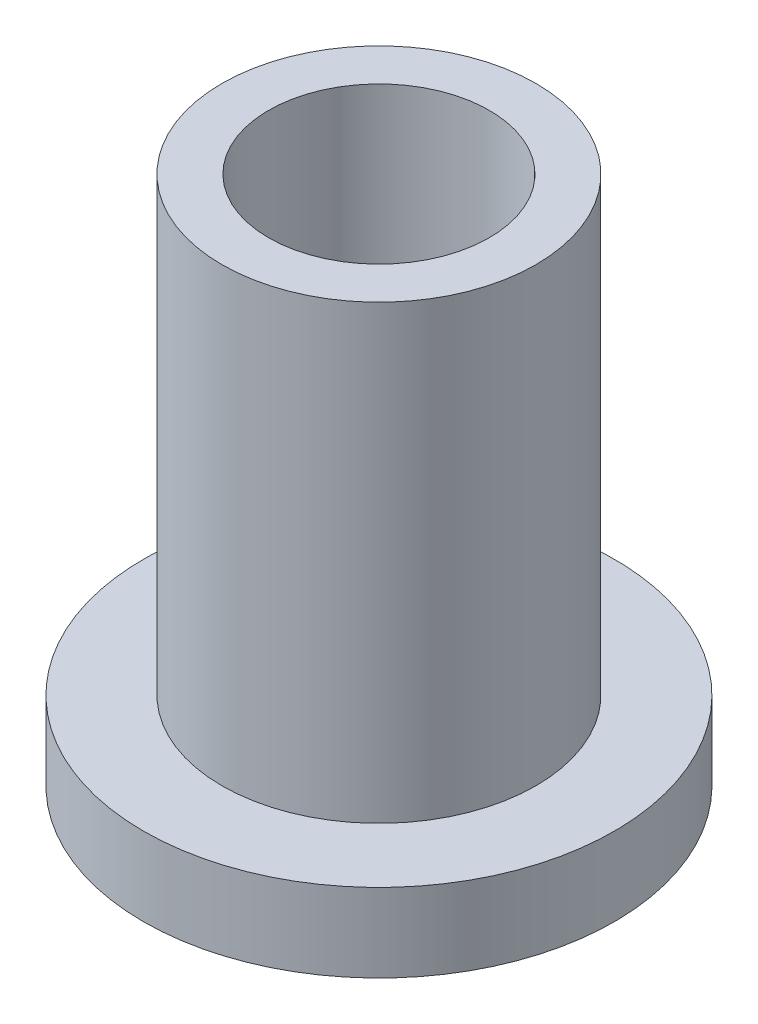
ISO-10303-21;
HEADER;
FILE_DESCRIPTION(('STEP AP214'),'2;1');
FILE_NAME('part.step','',(''),(''),'','','');
FILE_SCHEMA(('AUTOMOTIVE_DESIGN { 1 0 10303 214 1 1 1 1 }'));
ENDSEC;
DATA;
#1=APPLICATION_CONTEXT('core data for automotive mechanical design processes');
#2=APPLICATION_PROTOCOL_DEFINITION('international standard','automotive_design',2000,#1);
#3=PRODUCT_CONTEXT('',#1,'mechanical');
#4=PRODUCT('Part','Part','',(#3));
#5=PRODUCT_RELATED_PRODUCT_CATEGORY('part','',(#4));
#6=PRODUCT_DEFINITION_FORMATION('','',#4);
#7=PRODUCT_DEFINITION_CONTEXT('part definition',#1,'design');
#8=PRODUCT_DEFINITION('design','',#6,#7);
#9=PRODUCT_DEFINITION_SHAPE('','',#8);
#10=(LENGTH_UNIT() NAMED_UNIT(*) SI_UNIT(.MILLI.,.METRE.));
#11=(NAMED_UNIT(*) PLANE_ANGLE_UNIT() SI_UNIT($,.RADIAN.));
#12=(NAMED_UNIT(*) SI_UNIT($,.STERADIAN.) SOLID_ANGLE_UNIT());
#13=UNCERTAINTY_MEASURE_WITH_UNIT(LENGTH_MEASURE(1.E-05),#10,'distance_accuracy_value','');
#14=(GEOMETRIC_REPRESENTATION_CONTEXT(3) GLOBAL_UNCERTAINTY_ASSIGNED_CONTEXT((#13)) GLOBAL_UNIT_ASSIGNED_CONTEXT((#10,
#11,#12)) REPRESENTATION_CONTEXT('',''));
#15=CARTESIAN_POINT('',(0.,0.,0.));
#16=DIRECTION('',(0.,0.,1.));
#17=DIRECTION('',(1.,0.,0.));
#18=AXIS2_PLACEMENT_3D('',#15,#16,#17);
#19=CARTESIAN_POINT('',(0.,17.145,0.));
#20=DIRECTION('',(0.,-1.,0.));
#21=DIRECTION('',(0.,0.,-1.));
#22=AXIS2_PLACEMENT_3D('',#19,#20,#21);
#23=CYLINDRICAL_SURFACE('',#22,3.571875);
#24=CARTESIAN_POINT('',(0.,17.145,0.));
#25=DIRECTION('',(0.,1.,0.));
#26=DIRECTION('',(0.,0.,1.));
#27=AXIS2_PLACEMENT_3D('',#24,#25,#26);
#28=CIRCLE('',#27,3.571875);
#29=CARTESIAN_POINT('',(0.,17.145,3.571875));
#30=VERTEX_POINT('',#29);
#31=EDGE_CURVE('E41',#30,#30,#28,.T.);
#32=ORIENTED_EDGE('',*,*,#31,.T.);
#33=EDGE_LOOP('',(#32));
#34=FACE_BOUND('',#33,.T.);
#35=CARTESIAN_POINT('',(0.,0.,0.));
#36=DIRECTION('',(0.,1.,0.));
#37=DIRECTION('',(0.,0.,1.));
#38=AXIS2_PLACEMENT_3D('',#35,#36,#37);
#39=CIRCLE('',#38,3.571875);
#40=CARTESIAN_POINT('',(0.,0.,3.571875));
#41=VERTEX_POINT('',#40);
#42=EDGE_CURVE('E37',#41,#41,#39,.T.);
#43=ORIENTED_EDGE('',*,*,#42,.F.);
#44=EDGE_LOOP('',(#43));
#45=FACE_BOUND('',#44,.T.);
#46=ADVANCED_FACE('F34',(#34,#45),#23,.F.);
#47=CARTESIAN_POINT('',(0.,17.145,0.));
#48=DIRECTION('',(0.,-1.,0.));
#49=DIRECTION('',(0.,0.,-1.));
#50=AXIS2_PLACEMENT_3D('',#47,#48,#49);
#51=CYLINDRICAL_SURFACE('',#50,5.08);
#52=CARTESIAN_POINT('',(0.,2.54,0.));
#53=DIRECTION('',(0.,1.,0.));
#54=DIRECTION('',(0.,0.,1.));
#55=AXIS2_PLACEMENT_3D('',#52,#53,#54);
#56=CIRCLE('',#55,5.08);
#57=CARTESIAN_POINT('',(0.,2.54,5.08));
#58=VERTEX_POINT('',#57);
#59=EDGE_CURVE('E50',#58,#58,#56,.T.);
#60=ORIENTED_EDGE('',*,*,#59,.T.);
#61=EDGE_LOOP('',(#60));
#62=FACE_BOUND('',#61,.T.);
#63=CARTESIAN_POINT('',(0.,17.145,0.));
#64=DIRECTION('',(0.,1.,0.));
#65=DIRECTION('',(0.,0.,1.));
#66=AXIS2_PLACEMENT_3D('',#63,#64,#65);
#67=CIRCLE('',#66,5.08);
#68=CARTESIAN_POINT('',(0.,17.145,5.08));
#69=VERTEX_POINT('',#68);
#70=EDGE_CURVE('E10',#69,#69,#67,.T.);
#71=ORIENTED_EDGE('',*,*,#70,.F.);
#72=EDGE_LOOP('',(#71));
#73=FACE_BOUND('',#72,.T.);
#74=ADVANCED_FACE('F57',(#62,#73),#51,.T.);
#75=CARTESIAN_POINT('',(0.,17.145,0.));
#76=DIRECTION('',(0.,1.,0.));
#77=DIRECTION('',(0.,0.,1.));
#78=AXIS2_PLACEMENT_3D('',#75,#76,#77);
#79=PLANE('',#78);
#80=ORIENTED_EDGE('',*,*,#31,.F.);
#81=EDGE_LOOP('',(#80));
#82=FACE_BOUND('',#81,.T.);
#83=ORIENTED_EDGE('',*,*,#70,.T.);
#84=EDGE_LOOP('',(#83));
#85=FACE_BOUND('',#84,.T.);
#86=ADVANCED_FACE('F74',(#82,#85),#79,.T.);
#87=CARTESIAN_POINT('',(0.,0.,0.));
#88=DIRECTION('',(0.,1.,0.));
#89=DIRECTION('',(0.,0.,1.));
#90=AXIS2_PLACEMENT_3D('',#87,#88,#89);
#91=PLANE('',#90);
#92=ORIENTED_EDGE('',*,*,#42,.T.);
#93=EDGE_LOOP('',(#92));
#94=FACE_BOUND('',#93,.T.);
#95=CARTESIAN_POINT('',(0.,0.,0.));
#96=DIRECTION('',(0.,1.,0.));
#97=DIRECTION('',(0.,0.,1.));
#98=AXIS2_PLACEMENT_3D('',#95,#96,#97);
#99=CIRCLE('',#98,7.62);
#100=CARTESIAN_POINT('',(0.,0.,7.62));
#101=VERTEX_POINT('',#100);
#102=EDGE_CURVE('E47',#101,#101,#99,.T.);
#103=ORIENTED_EDGE('',*,*,#102,.F.);
#104=EDGE_LOOP('',(#103));
#105=FACE_BOUND('',#104,.T.);
#106=ADVANCED_FACE('F69',(#94,#105),#91,.F.);
#107=CARTESIAN_POINT('',(0.,2.54,0.));
#108=DIRECTION('',(0.,-1.,0.));
#109=DIRECTION('',(0.,0.,-1.));
#110=AXIS2_PLACEMENT_3D('',#107,#108,#109);
#111=CYLINDRICAL_SURFACE('',#110,7.62);
#112=CARTESIAN_POINT('',(0.,2.54,0.));
#113=DIRECTION('',(0.,1.,0.));
#114=DIRECTION('',(0.,0.,1.));
#115=AXIS2_PLACEMENT_3D('',#112,#113,#114);
#116=CIRCLE('',#115,7.62);
#117=CARTESIAN_POINT('',(0.,2.54,7.62));
#118=VERTEX_POINT('',#117);
#119=EDGE_CURVE('E51',#118,#118,#116,.T.);
#120=ORIENTED_EDGE('',*,*,#119,.F.);
#121=EDGE_LOOP('',(#120));
#122=FACE_BOUND('',#121,.T.);
#123=ORIENTED_EDGE('',*,*,#102,.T.);
#124=EDGE_LOOP('',(#123));
#125=FACE_BOUND('',#124,.T.);
#126=ADVANCED_FACE('F63',(#122,#125),#111,.T.);
#127=CARTESIAN_POINT('',(0.,2.54,0.));
#128=DIRECTION('',(0.,1.,0.));
#129=DIRECTION('',(0.,0.,1.));
#130=AXIS2_PLACEMENT_3D('',#127,#128,#129);
#131=PLANE('',#130);
#132=ORIENTED_EDGE('',*,*,#59,.F.);
#133=EDGE_LOOP('',(#132));
#134=FACE_BOUND('',#133,.T.);
#135=ORIENTED_EDGE('',*,*,#119,.T.);
#136=EDGE_LOOP('',(#135));
#137=FACE_BOUND('',#136,.T.);
#138=ADVANCED_FACE('F60',(#134,#137),#131,.T.);
#139=CLOSED_SHELL('',(#46,#74,#86,#106,#126,#138));
#140=MANIFOLD_SOLID_BREP('B2',#139);
#141=ADVANCED_BREP_SHAPE_REPRESENTATION('',(#18,#140),#14);
#142=SHAPE_DEFINITION_REPRESENTATION(#9,#141);
ENDSEC;
END-ISO-10303-21;
